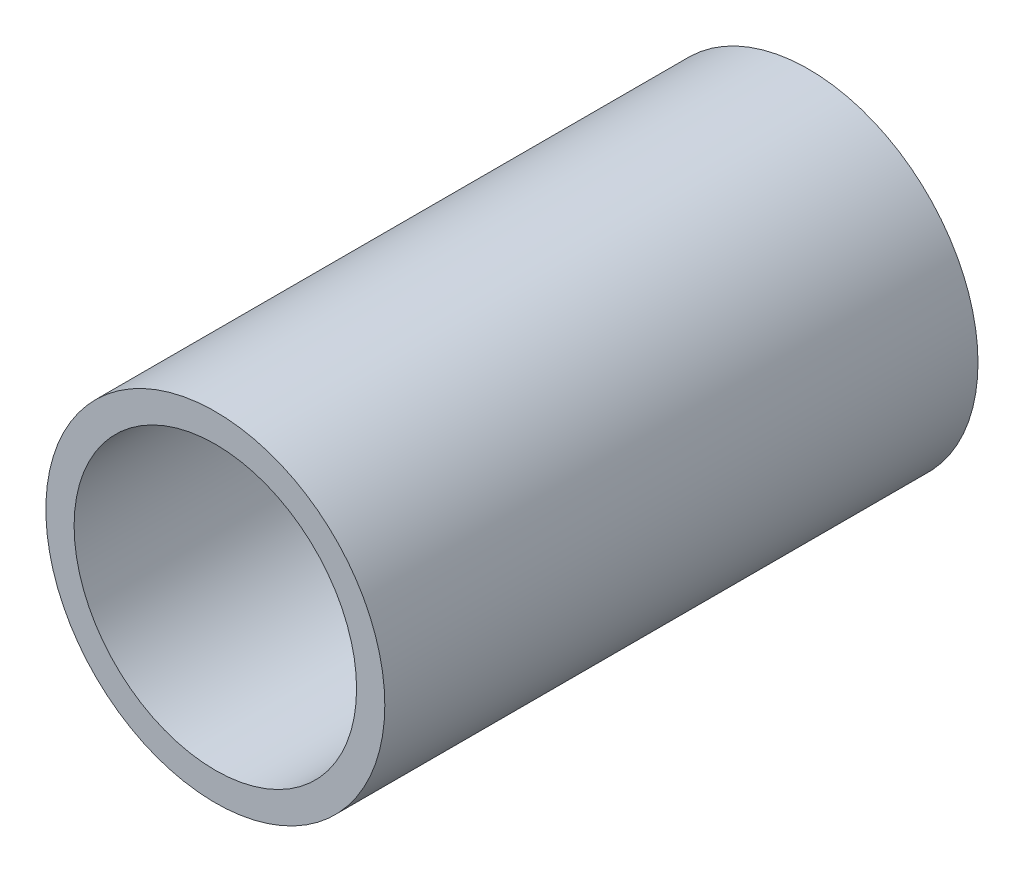
ISO-10303-21;
HEADER;
FILE_DESCRIPTION(('STEP AP214'),'2;1');
FILE_NAME('part.step','',(''),(''),'','','');
FILE_SCHEMA(('AUTOMOTIVE_DESIGN { 1 0 10303 214 1 1 1 1 }'));
ENDSEC;
DATA;
#1=APPLICATION_CONTEXT('core data for automotive mechanical design processes');
#2=APPLICATION_PROTOCOL_DEFINITION('international standard','automotive_design',2000,#1);
#3=PRODUCT_CONTEXT('',#1,'mechanical');
#4=PRODUCT('Part','Part','',(#3));
#5=PRODUCT_RELATED_PRODUCT_CATEGORY('part','',(#4));
#6=PRODUCT_DEFINITION_FORMATION('','',#4);
#7=PRODUCT_DEFINITION_CONTEXT('part definition',#1,'design');
#8=PRODUCT_DEFINITION('design','',#6,#7);
#9=PRODUCT_DEFINITION_SHAPE('','',#8);
#10=(LENGTH_UNIT() NAMED_UNIT(*) SI_UNIT(.MILLI.,.METRE.));
#11=(NAMED_UNIT(*) PLANE_ANGLE_UNIT() SI_UNIT($,.RADIAN.));
#12=(NAMED_UNIT(*) SI_UNIT($,.STERADIAN.) SOLID_ANGLE_UNIT());
#13=UNCERTAINTY_MEASURE_WITH_UNIT(LENGTH_MEASURE(1.E-05),#10,'distance_accuracy_value','');
#14=(GEOMETRIC_REPRESENTATION_CONTEXT(3) GLOBAL_UNCERTAINTY_ASSIGNED_CONTEXT((#13)) GLOBAL_UNIT_ASSIGNED_CONTEXT((#10,
#11,#12)) REPRESENTATION_CONTEXT('',''));
#15=CARTESIAN_POINT('',(0.,0.,0.));
#16=DIRECTION('',(0.,0.,1.));
#17=DIRECTION('',(1.,0.,0.));
#18=AXIS2_PLACEMENT_3D('',#15,#16,#17);
#19=CARTESIAN_POINT('',(0.,0.,21.));
#20=DIRECTION('',(0.,0.,1.));
#21=DIRECTION('',(1.,0.,0.));
#22=AXIS2_PLACEMENT_3D('',#19,#20,#21);
#23=PLANE('',#22);
#24=CARTESIAN_POINT('',(0.,0.,21.));
#25=DIRECTION('',(0.,0.,1.));
#26=DIRECTION('',(1.,0.,0.));
#27=AXIS2_PLACEMENT_3D('',#24,#25,#26);
#28=CIRCLE('',#27,12.);
#29=CARTESIAN_POINT('',(12.,0.,21.));
#30=VERTEX_POINT('',#29);
#31=EDGE_CURVE('E11',#30,#30,#28,.T.);
#32=ORIENTED_EDGE('',*,*,#31,.T.);
#33=EDGE_LOOP('',(#32));
#34=FACE_BOUND('',#33,.T.);
#35=CARTESIAN_POINT('',(0.,0.,21.));
#36=DIRECTION('',(0.,0.,1.));
#37=DIRECTION('',(1.,0.,0.));
#38=AXIS2_PLACEMENT_3D('',#35,#36,#37);
#39=CIRCLE('',#38,10.);
#40=CARTESIAN_POINT('',(10.,0.,21.));
#41=VERTEX_POINT('',#40);
#42=EDGE_CURVE('E64',#41,#41,#39,.T.);
#43=ORIENTED_EDGE('',*,*,#42,.F.);
#44=EDGE_LOOP('',(#43));
#45=FACE_BOUND('',#44,.T.);
#46=ADVANCED_FACE('F51',(#34,#45),#23,.T.);
#47=CARTESIAN_POINT('',(0.,0.,-21.));
#48=DIRECTION('',(0.,0.,1.));
#49=DIRECTION('',(1.,0.,0.));
#50=AXIS2_PLACEMENT_3D('',#47,#48,#49);
#51=PLANE('',#50);
#52=CARTESIAN_POINT('',(0.,0.,-21.));
#53=DIRECTION('',(0.,0.,1.));
#54=DIRECTION('',(1.,0.,0.));
#55=AXIS2_PLACEMENT_3D('',#52,#53,#54);
#56=CIRCLE('',#55,12.);
#57=CARTESIAN_POINT('',(12.,0.,-21.));
#58=VERTEX_POINT('',#57);
#59=EDGE_CURVE('E55',#58,#58,#56,.T.);
#60=ORIENTED_EDGE('',*,*,#59,.F.);
#61=EDGE_LOOP('',(#60));
#62=FACE_BOUND('',#61,.T.);
#63=CARTESIAN_POINT('',(0.,0.,-21.));
#64=DIRECTION('',(0.,0.,1.));
#65=DIRECTION('',(1.,0.,0.));
#66=AXIS2_PLACEMENT_3D('',#63,#64,#65);
#67=CIRCLE('',#66,10.);
#68=CARTESIAN_POINT('',(10.,0.,-21.));
#69=VERTEX_POINT('',#68);
#70=EDGE_CURVE('E66',#69,#69,#67,.T.);
#71=ORIENTED_EDGE('',*,*,#70,.T.);
#72=EDGE_LOOP('',(#71));
#73=FACE_BOUND('',#72,.T.);
#74=ADVANCED_FACE('F78',(#62,#73),#51,.F.);
#75=CARTESIAN_POINT('',(0.,0.,21.));
#76=DIRECTION('',(0.,0.,-1.));
#77=DIRECTION('',(-1.,0.,0.));
#78=AXIS2_PLACEMENT_3D('',#75,#76,#77);
#79=CYLINDRICAL_SURFACE('',#78,12.);
#80=ORIENTED_EDGE('',*,*,#31,.F.);
#81=EDGE_LOOP('',(#80));
#82=FACE_BOUND('',#81,.T.);
#83=ORIENTED_EDGE('',*,*,#59,.T.);
#84=EDGE_LOOP('',(#83));
#85=FACE_BOUND('',#84,.T.);
#86=ADVANCED_FACE('F53',(#82,#85),#79,.T.);
#87=CARTESIAN_POINT('',(0.,0.,21.));
#88=DIRECTION('',(0.,0.,-1.));
#89=DIRECTION('',(-1.,0.,0.));
#90=AXIS2_PLACEMENT_3D('',#87,#88,#89);
#91=CYLINDRICAL_SURFACE('',#90,10.);
#92=ORIENTED_EDGE('',*,*,#42,.T.);
#93=EDGE_LOOP('',(#92));
#94=FACE_BOUND('',#93,.T.);
#95=ORIENTED_EDGE('',*,*,#70,.F.);
#96=EDGE_LOOP('',(#95));
#97=FACE_BOUND('',#96,.T.);
#98=ADVANCED_FACE('F74',(#94,#97),#91,.F.);
#99=CLOSED_SHELL('',(#46,#74,#86,#98));
#100=MANIFOLD_SOLID_BREP('B2',#99);
#101=ADVANCED_BREP_SHAPE_REPRESENTATION('',(#18,#100),#14);
#102=SHAPE_DEFINITION_REPRESENTATION(#9,#101);
ENDSEC;
END-ISO-10303-21;
